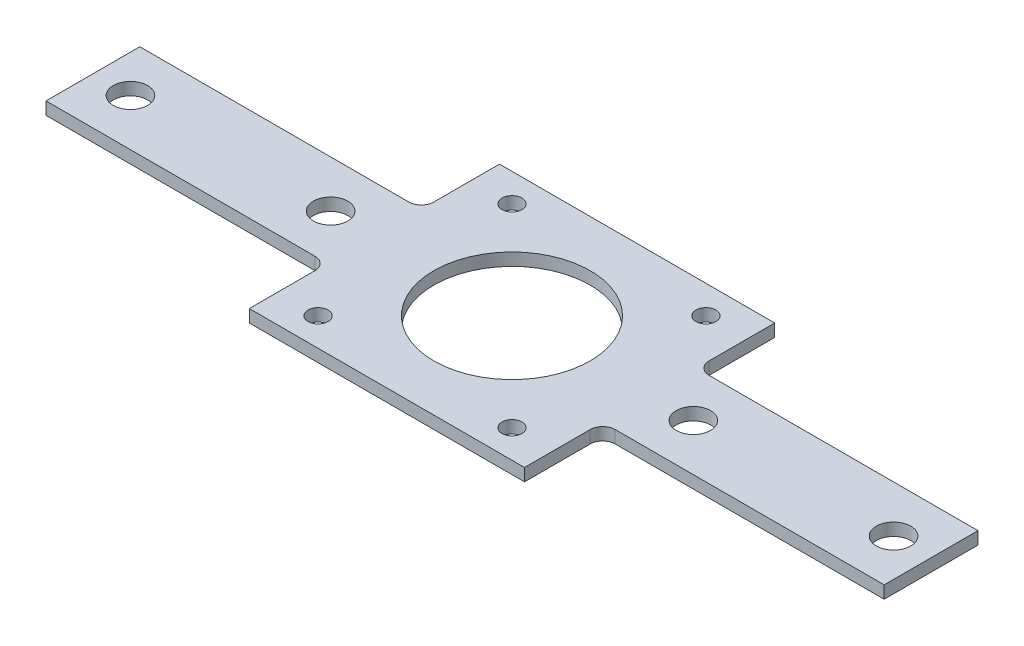
ISO-10303-21;
HEADER;
FILE_DESCRIPTION(('STEP AP214'),'2;1');
FILE_NAME('part.step','',(''),(''),'','','');
FILE_SCHEMA(('AUTOMOTIVE_DESIGN { 1 0 10303 214 1 1 1 1 }'));
ENDSEC;
DATA;
#1=APPLICATION_CONTEXT('core data for automotive mechanical design processes');
#2=APPLICATION_PROTOCOL_DEFINITION('international standard','automotive_design',2000,#1);
#3=PRODUCT_CONTEXT('',#1,'mechanical');
#4=PRODUCT('Part','Part','',(#3));
#5=PRODUCT_RELATED_PRODUCT_CATEGORY('part','',(#4));
#6=PRODUCT_DEFINITION_FORMATION('','',#4);
#7=PRODUCT_DEFINITION_CONTEXT('part definition',#1,'design');
#8=PRODUCT_DEFINITION('design','',#6,#7);
#9=PRODUCT_DEFINITION_SHAPE('','',#8);
#10=(LENGTH_UNIT() NAMED_UNIT(*) SI_UNIT(.MILLI.,.METRE.));
#11=(NAMED_UNIT(*) PLANE_ANGLE_UNIT() SI_UNIT($,.RADIAN.));
#12=(NAMED_UNIT(*) SI_UNIT($,.STERADIAN.) SOLID_ANGLE_UNIT());
#13=UNCERTAINTY_MEASURE_WITH_UNIT(LENGTH_MEASURE(1.E-05),#10,'distance_accuracy_value','');
#14=(GEOMETRIC_REPRESENTATION_CONTEXT(3) GLOBAL_UNCERTAINTY_ASSIGNED_CONTEXT((#13)) GLOBAL_UNIT_ASSIGNED_CONTEXT((#10,
#11,#12)) REPRESENTATION_CONTEXT('',''));
#15=CARTESIAN_POINT('',(0.,0.,0.));
#16=DIRECTION('',(0.,0.,1.));
#17=DIRECTION('',(1.,0.,0.));
#18=AXIS2_PLACEMENT_3D('',#15,#16,#17);
#19=CARTESIAN_POINT('',(0.,2.,0.));
#20=DIRECTION('',(0.,1.,0.));
#21=DIRECTION('',(0.,0.,1.));
#22=AXIS2_PLACEMENT_3D('',#19,#20,#21);
#23=PLANE('',#22);
#24=DIRECTION('',(-1.,0.,0.));
#25=VECTOR('',#24,1.);
#26=CARTESIAN_POINT('',(22.,2.,-7.5));
#27=LINE('',#26,#25);
#28=CARTESIAN_POINT('',(67.,2.,-7.5));
#29=VERTEX_POINT('',#28);
#30=CARTESIAN_POINT('',(24.,2.,-7.5));
#31=VERTEX_POINT('',#30);
#32=EDGE_CURVE('E156',#29,#31,#27,.T.);
#33=ORIENTED_EDGE('',*,*,#32,.T.);
#34=CARTESIAN_POINT('',(24.,2.,-9.5));
#35=DIRECTION('',(0.,1.,0.));
#36=DIRECTION('',(0.,0.,1.));
#37=AXIS2_PLACEMENT_3D('',#34,#35,#36);
#38=CIRCLE('',#37,2.);
#39=CARTESIAN_POINT('',(22.,2.,-9.5));
#40=VERTEX_POINT('',#39);
#41=EDGE_CURVE('E11',#31,#40,#38,.F.);
#42=ORIENTED_EDGE('',*,*,#41,.T.);
#43=DIRECTION('',(0.,0.,-1.));
#44=VECTOR('',#43,1.);
#45=CARTESIAN_POINT('',(22.,2.,-20.));
#46=LINE('',#45,#44);
#47=CARTESIAN_POINT('',(22.,2.,-20.));
#48=VERTEX_POINT('',#47);
#49=EDGE_CURVE('E145',#40,#48,#46,.T.);
#50=ORIENTED_EDGE('',*,*,#49,.T.);
#51=DIRECTION('',(-1.,0.,0.));
#52=VECTOR('',#51,1.);
#53=CARTESIAN_POINT('',(-70.,2.,-20.));
#54=LINE('',#53,#52);
#55=CARTESIAN_POINT('',(-22.,2.,-20.));
#56=VERTEX_POINT('',#55);
#57=EDGE_CURVE('E150',#48,#56,#54,.T.);
#58=ORIENTED_EDGE('',*,*,#57,.T.);
#59=DIRECTION('',(0.,0.,1.));
#60=VECTOR('',#59,1.);
#61=CARTESIAN_POINT('',(-22.,2.,-20.));
#62=LINE('',#61,#60);
#63=CARTESIAN_POINT('',(-22.,2.,-9.5));
#64=VERTEX_POINT('',#63);
#65=EDGE_CURVE('E257',#56,#64,#62,.T.);
#66=ORIENTED_EDGE('',*,*,#65,.T.);
#67=CARTESIAN_POINT('',(-24.,2.,-9.5));
#68=DIRECTION('',(0.,1.,0.));
#69=DIRECTION('',(0.,0.,1.));
#70=AXIS2_PLACEMENT_3D('',#67,#68,#69);
#71=CIRCLE('',#70,2.);
#72=CARTESIAN_POINT('',(-24.,2.,-7.5));
#73=VERTEX_POINT('',#72);
#74=EDGE_CURVE('E209',#64,#73,#71,.F.);
#75=ORIENTED_EDGE('',*,*,#74,.T.);
#76=DIRECTION('',(-1.,0.,0.));
#77=VECTOR('',#76,1.);
#78=CARTESIAN_POINT('',(-22.,2.,-7.5));
#79=LINE('',#78,#77);
#80=CARTESIAN_POINT('',(-67.,2.,-7.5));
#81=VERTEX_POINT('',#80);
#82=EDGE_CURVE('E259',#73,#81,#79,.T.);
#83=ORIENTED_EDGE('',*,*,#82,.T.);
#84=DIRECTION('',(0.,0.,1.));
#85=VECTOR('',#84,1.);
#86=CARTESIAN_POINT('',(-67.,2.,-7.5));
#87=LINE('',#86,#85);
#88=CARTESIAN_POINT('',(-67.,2.,7.5));
#89=VERTEX_POINT('',#88);
#90=EDGE_CURVE('E261',#81,#89,#87,.T.);
#91=ORIENTED_EDGE('',*,*,#90,.T.);
#92=DIRECTION('',(1.,0.,0.));
#93=VECTOR('',#92,1.);
#94=CARTESIAN_POINT('',(-67.,2.,7.5));
#95=LINE('',#94,#93);
#96=CARTESIAN_POINT('',(-24.,2.,7.5));
#97=VERTEX_POINT('',#96);
#98=EDGE_CURVE('E264',#89,#97,#95,.T.);
#99=ORIENTED_EDGE('',*,*,#98,.T.);
#100=CARTESIAN_POINT('',(-24.,2.,9.5));
#101=DIRECTION('',(0.,1.,0.));
#102=DIRECTION('',(0.,0.,1.));
#103=AXIS2_PLACEMENT_3D('',#100,#101,#102);
#104=CIRCLE('',#103,2.);
#105=CARTESIAN_POINT('',(-22.,2.,9.5));
#106=VERTEX_POINT('',#105);
#107=EDGE_CURVE('E205',#97,#106,#104,.F.);
#108=ORIENTED_EDGE('',*,*,#107,.T.);
#109=DIRECTION('',(0.,0.,1.));
#110=VECTOR('',#109,1.);
#111=CARTESIAN_POINT('',(-22.,2.,7.5));
#112=LINE('',#111,#110);
#113=CARTESIAN_POINT('',(-22.,2.,20.));
#114=VERTEX_POINT('',#113);
#115=EDGE_CURVE('E267',#106,#114,#112,.T.);
#116=ORIENTED_EDGE('',*,*,#115,.T.);
#117=DIRECTION('',(1.,0.,0.));
#118=VECTOR('',#117,1.);
#119=CARTESIAN_POINT('',(-70.,2.,20.));
#120=LINE('',#119,#118);
#121=CARTESIAN_POINT('',(22.,2.,20.));
#122=VERTEX_POINT('',#121);
#123=EDGE_CURVE('E171',#114,#122,#120,.T.);
#124=ORIENTED_EDGE('',*,*,#123,.T.);
#125=DIRECTION('',(0.,0.,-1.));
#126=VECTOR('',#125,1.);
#127=CARTESIAN_POINT('',(22.,2.,7.5));
#128=LINE('',#127,#126);
#129=CARTESIAN_POINT('',(22.,2.,9.5));
#130=VERTEX_POINT('',#129);
#131=EDGE_CURVE('E220',#122,#130,#128,.T.);
#132=ORIENTED_EDGE('',*,*,#131,.T.);
#133=CARTESIAN_POINT('',(24.,2.,9.5));
#134=DIRECTION('',(0.,1.,0.));
#135=DIRECTION('',(0.,0.,1.));
#136=AXIS2_PLACEMENT_3D('',#133,#134,#135);
#137=CIRCLE('',#136,2.);
#138=CARTESIAN_POINT('',(24.,2.,7.5));
#139=VERTEX_POINT('',#138);
#140=EDGE_CURVE('E213',#130,#139,#137,.F.);
#141=ORIENTED_EDGE('',*,*,#140,.T.);
#142=DIRECTION('',(1.,0.,0.));
#143=VECTOR('',#142,1.);
#144=CARTESIAN_POINT('',(67.,2.,7.5));
#145=LINE('',#144,#143);
#146=CARTESIAN_POINT('',(67.,2.,7.5));
#147=VERTEX_POINT('',#146);
#148=EDGE_CURVE('E218',#139,#147,#145,.T.);
#149=ORIENTED_EDGE('',*,*,#148,.T.);
#150=DIRECTION('',(0.,0.,-1.));
#151=VECTOR('',#150,1.);
#152=CARTESIAN_POINT('',(67.,2.,-7.5));
#153=LINE('',#152,#151);
#154=EDGE_CURVE('E230',#147,#29,#153,.T.);
#155=ORIENTED_EDGE('',*,*,#154,.T.);
#156=EDGE_LOOP('',(#33,#42,#50,#58,#66,#75,#83,#91,#99,#108,#116,#124,#132,#141,#149,#155));
#157=FACE_BOUND('',#156,.T.);
#158=CARTESIAN_POINT('',(15.5,2.,15.5));
#159=DIRECTION('',(0.,1.,0.));
#160=DIRECTION('',(0.,0.,1.));
#161=AXIS2_PLACEMENT_3D('',#158,#159,#160);
#162=CIRCLE('',#161,1.6);
#163=CARTESIAN_POINT('',(15.5,2.,17.1));
#164=VERTEX_POINT('',#163);
#165=EDGE_CURVE('E297',#164,#164,#162,.T.);
#166=ORIENTED_EDGE('',*,*,#165,.F.);
#167=EDGE_LOOP('',(#166));
#168=FACE_BOUND('',#167,.T.);
#169=CARTESIAN_POINT('',(-15.5,2.,-15.5));
#170=DIRECTION('',(0.,1.,0.));
#171=DIRECTION('',(0.,0.,1.));
#172=AXIS2_PLACEMENT_3D('',#169,#170,#171);
#173=CIRCLE('',#172,1.6);
#174=CARTESIAN_POINT('',(-15.5,2.,-13.9));
#175=VERTEX_POINT('',#174);
#176=EDGE_CURVE('E309',#175,#175,#173,.T.);
#177=ORIENTED_EDGE('',*,*,#176,.F.);
#178=EDGE_LOOP('',(#177));
#179=FACE_BOUND('',#178,.T.);
#180=CARTESIAN_POINT('',(29.,2.,0.));
#181=DIRECTION('',(0.,1.,0.));
#182=DIRECTION('',(0.,0.,1.));
#183=AXIS2_PLACEMENT_3D('',#180,#181,#182);
#184=CIRCLE('',#183,2.74999999999999);
#185=CARTESIAN_POINT('',(29.,2.,2.74999999999999));
#186=VERTEX_POINT('',#185);
#187=EDGE_CURVE('E321',#186,#186,#184,.T.);
#188=ORIENTED_EDGE('',*,*,#187,.F.);
#189=EDGE_LOOP('',(#188));
#190=FACE_BOUND('',#189,.T.);
#191=CARTESIAN_POINT('',(0.,2.,0.));
#192=DIRECTION('',(0.,1.,0.));
#193=DIRECTION('',(0.,0.,1.));
#194=AXIS2_PLACEMENT_3D('',#191,#192,#193);
#195=CIRCLE('',#194,12.5);
#196=CARTESIAN_POINT('',(0.,2.,12.5));
#197=VERTEX_POINT('',#196);
#198=EDGE_CURVE('E333',#197,#197,#195,.T.);
#199=ORIENTED_EDGE('',*,*,#198,.F.);
#200=EDGE_LOOP('',(#199));
#201=FACE_BOUND('',#200,.T.);
#202=CARTESIAN_POINT('',(-61.,2.,0.));
#203=DIRECTION('',(0.,1.,0.));
#204=DIRECTION('',(0.,0.,1.));
#205=AXIS2_PLACEMENT_3D('',#202,#203,#204);
#206=CIRCLE('',#205,2.75000000000001);
#207=CARTESIAN_POINT('',(-61.,2.,2.75000000000001));
#208=VERTEX_POINT('',#207);
#209=EDGE_CURVE('E184',#208,#208,#206,.T.);
#210=ORIENTED_EDGE('',*,*,#209,.F.);
#211=EDGE_LOOP('',(#210));
#212=FACE_BOUND('',#211,.T.);
#213=CARTESIAN_POINT('',(-29.,2.,0.));
#214=DIRECTION('',(0.,1.,0.));
#215=DIRECTION('',(0.,0.,1.));
#216=AXIS2_PLACEMENT_3D('',#213,#214,#215);
#217=CIRCLE('',#216,2.75);
#218=CARTESIAN_POINT('',(-29.,2.,2.75));
#219=VERTEX_POINT('',#218);
#220=EDGE_CURVE('E327',#219,#219,#217,.T.);
#221=ORIENTED_EDGE('',*,*,#220,.F.);
#222=EDGE_LOOP('',(#221));
#223=FACE_BOUND('',#222,.T.);
#224=CARTESIAN_POINT('',(61.,2.,0.));
#225=DIRECTION('',(0.,1.,0.));
#226=DIRECTION('',(0.,0.,1.));
#227=AXIS2_PLACEMENT_3D('',#224,#225,#226);
#228=CIRCLE('',#227,2.75000000000001);
#229=CARTESIAN_POINT('',(61.,2.,2.75000000000001));
#230=VERTEX_POINT('',#229);
#231=EDGE_CURVE('E315',#230,#230,#228,.T.);
#232=ORIENTED_EDGE('',*,*,#231,.F.);
#233=EDGE_LOOP('',(#232));
#234=FACE_BOUND('',#233,.T.);
#235=CARTESIAN_POINT('',(15.5,2.,-15.5));
#236=DIRECTION('',(0.,1.,0.));
#237=DIRECTION('',(0.,0.,1.));
#238=AXIS2_PLACEMENT_3D('',#235,#236,#237);
#239=CIRCLE('',#238,1.6);
#240=CARTESIAN_POINT('',(15.5,2.,-13.9));
#241=VERTEX_POINT('',#240);
#242=EDGE_CURVE('E303',#241,#241,#239,.T.);
#243=ORIENTED_EDGE('',*,*,#242,.F.);
#244=EDGE_LOOP('',(#243));
#245=FACE_BOUND('',#244,.T.);
#246=CARTESIAN_POINT('',(-15.5,2.,15.5));
#247=DIRECTION('',(0.,1.,0.));
#248=DIRECTION('',(0.,0.,1.));
#249=AXIS2_PLACEMENT_3D('',#246,#247,#248);
#250=CIRCLE('',#249,1.6);
#251=CARTESIAN_POINT('',(-15.5,2.,17.1));
#252=VERTEX_POINT('',#251);
#253=EDGE_CURVE('E291',#252,#252,#250,.T.);
#254=ORIENTED_EDGE('',*,*,#253,.F.);
#255=EDGE_LOOP('',(#254));
#256=FACE_BOUND('',#255,.T.);
#257=ADVANCED_FACE('F33',(#157,#168,#179,#190,#201,#212,#223,#234,#245,#256),#23,.T.);
#258=CARTESIAN_POINT('',(0.,0.,0.));
#259=DIRECTION('',(0.,1.,0.));
#260=DIRECTION('',(0.,0.,1.));
#261=AXIS2_PLACEMENT_3D('',#258,#259,#260);
#262=PLANE('',#261);
#263=DIRECTION('',(-1.,0.,0.));
#264=VECTOR('',#263,1.);
#265=CARTESIAN_POINT('',(-70.,0.,-20.));
#266=LINE('',#265,#264);
#267=CARTESIAN_POINT('',(22.,0.,-20.));
#268=VERTEX_POINT('',#267);
#269=CARTESIAN_POINT('',(-22.,0.,-20.));
#270=VERTEX_POINT('',#269);
#271=EDGE_CURVE('E178',#268,#270,#266,.T.);
#272=ORIENTED_EDGE('',*,*,#271,.F.);
#273=DIRECTION('',(0.,0.,-1.));
#274=VECTOR('',#273,1.);
#275=CARTESIAN_POINT('',(22.,0.,-20.));
#276=LINE('',#275,#274);
#277=CARTESIAN_POINT('',(22.,0.,-9.5));
#278=VERTEX_POINT('',#277);
#279=EDGE_CURVE('E161',#278,#268,#276,.T.);
#280=ORIENTED_EDGE('',*,*,#279,.F.);
#281=CARTESIAN_POINT('',(24.,0.,-9.5));
#282=DIRECTION('',(0.,1.,0.));
#283=DIRECTION('',(0.,0.,1.));
#284=AXIS2_PLACEMENT_3D('',#281,#282,#283);
#285=CIRCLE('',#284,2.);
#286=CARTESIAN_POINT('',(24.,0.,-7.5));
#287=VERTEX_POINT('',#286);
#288=EDGE_CURVE('E41',#278,#287,#285,.T.);
#289=ORIENTED_EDGE('',*,*,#288,.T.);
#290=DIRECTION('',(-1.,0.,0.));
#291=VECTOR('',#290,1.);
#292=CARTESIAN_POINT('',(22.,0.,-7.5));
#293=LINE('',#292,#291);
#294=CARTESIAN_POINT('',(67.,0.,-7.5));
#295=VERTEX_POINT('',#294);
#296=EDGE_CURVE('E251',#295,#287,#293,.T.);
#297=ORIENTED_EDGE('',*,*,#296,.F.);
#298=DIRECTION('',(0.,0.,-1.));
#299=VECTOR('',#298,1.);
#300=CARTESIAN_POINT('',(67.,0.,-7.5));
#301=LINE('',#300,#299);
#302=CARTESIAN_POINT('',(67.,0.,7.5));
#303=VERTEX_POINT('',#302);
#304=EDGE_CURVE('E245',#303,#295,#301,.T.);
#305=ORIENTED_EDGE('',*,*,#304,.F.);
#306=DIRECTION('',(1.,0.,0.));
#307=VECTOR('',#306,1.);
#308=CARTESIAN_POINT('',(67.,0.,7.5));
#309=LINE('',#308,#307);
#310=CARTESIAN_POINT('',(24.,0.,7.5));
#311=VERTEX_POINT('',#310);
#312=EDGE_CURVE('E239',#311,#303,#309,.T.);
#313=ORIENTED_EDGE('',*,*,#312,.F.);
#314=CARTESIAN_POINT('',(24.,0.,9.5));
#315=DIRECTION('',(0.,1.,0.));
#316=DIRECTION('',(0.,0.,1.));
#317=AXIS2_PLACEMENT_3D('',#314,#315,#316);
#318=CIRCLE('',#317,2.);
#319=CARTESIAN_POINT('',(22.,0.,9.5));
#320=VERTEX_POINT('',#319);
#321=EDGE_CURVE('E211',#311,#320,#318,.T.);
#322=ORIENTED_EDGE('',*,*,#321,.T.);
#323=DIRECTION('',(0.,0.,-1.));
#324=VECTOR('',#323,1.);
#325=CARTESIAN_POINT('',(22.,0.,7.5));
#326=LINE('',#325,#324);
#327=CARTESIAN_POINT('',(22.,0.,20.));
#328=VERTEX_POINT('',#327);
#329=EDGE_CURVE('E155',#328,#320,#326,.T.);
#330=ORIENTED_EDGE('',*,*,#329,.F.);
#331=DIRECTION('',(1.,0.,0.));
#332=VECTOR('',#331,1.);
#333=CARTESIAN_POINT('',(-70.,0.,20.));
#334=LINE('',#333,#332);
#335=CARTESIAN_POINT('',(-22.,0.,20.));
#336=VERTEX_POINT('',#335);
#337=EDGE_CURVE('E172',#336,#328,#334,.T.);
#338=ORIENTED_EDGE('',*,*,#337,.F.);
#339=DIRECTION('',(0.,0.,1.));
#340=VECTOR('',#339,1.);
#341=CARTESIAN_POINT('',(-22.,0.,7.5));
#342=LINE('',#341,#340);
#343=CARTESIAN_POINT('',(-22.,0.,9.5));
#344=VERTEX_POINT('',#343);
#345=EDGE_CURVE('E280',#344,#336,#342,.T.);
#346=ORIENTED_EDGE('',*,*,#345,.F.);
#347=CARTESIAN_POINT('',(-24.,0.,9.5));
#348=DIRECTION('',(0.,1.,0.));
#349=DIRECTION('',(0.,0.,1.));
#350=AXIS2_PLACEMENT_3D('',#347,#348,#349);
#351=CIRCLE('',#350,2.);
#352=CARTESIAN_POINT('',(-24.,0.,7.5));
#353=VERTEX_POINT('',#352);
#354=EDGE_CURVE('E203',#344,#353,#351,.T.);
#355=ORIENTED_EDGE('',*,*,#354,.T.);
#356=DIRECTION('',(1.,0.,0.));
#357=VECTOR('',#356,1.);
#358=CARTESIAN_POINT('',(-67.,0.,7.5));
#359=LINE('',#358,#357);
#360=CARTESIAN_POINT('',(-67.,0.,7.5));
#361=VERTEX_POINT('',#360);
#362=EDGE_CURVE('E277',#361,#353,#359,.T.);
#363=ORIENTED_EDGE('',*,*,#362,.F.);
#364=DIRECTION('',(0.,0.,1.));
#365=VECTOR('',#364,1.);
#366=CARTESIAN_POINT('',(-67.,0.,-7.5));
#367=LINE('',#366,#365);
#368=CARTESIAN_POINT('',(-67.,0.,-7.5));
#369=VERTEX_POINT('',#368);
#370=EDGE_CURVE('E274',#369,#361,#367,.T.);
#371=ORIENTED_EDGE('',*,*,#370,.F.);
#372=DIRECTION('',(-1.,0.,0.));
#373=VECTOR('',#372,1.);
#374=CARTESIAN_POINT('',(-22.,0.,-7.5));
#375=LINE('',#374,#373);
#376=CARTESIAN_POINT('',(-24.,0.,-7.5));
#377=VERTEX_POINT('',#376);
#378=EDGE_CURVE('E272',#377,#369,#375,.T.);
#379=ORIENTED_EDGE('',*,*,#378,.F.);
#380=CARTESIAN_POINT('',(-24.,0.,-9.5));
#381=DIRECTION('',(0.,1.,0.));
#382=DIRECTION('',(0.,0.,1.));
#383=AXIS2_PLACEMENT_3D('',#380,#381,#382);
#384=CIRCLE('',#383,2.);
#385=CARTESIAN_POINT('',(-22.,0.,-9.5));
#386=VERTEX_POINT('',#385);
#387=EDGE_CURVE('E207',#377,#386,#384,.T.);
#388=ORIENTED_EDGE('',*,*,#387,.T.);
#389=DIRECTION('',(0.,0.,1.));
#390=VECTOR('',#389,1.);
#391=CARTESIAN_POINT('',(-22.,0.,-20.));
#392=LINE('',#391,#390);
#393=EDGE_CURVE('E269',#270,#386,#392,.T.);
#394=ORIENTED_EDGE('',*,*,#393,.F.);
#395=EDGE_LOOP('',(#272,#280,#289,#297,#305,#313,#322,#330,#338,#346,#355,#363,#371,#379,#388,#394));
#396=FACE_BOUND('',#395,.T.);
#397=CARTESIAN_POINT('',(-61.,0.,0.));
#398=DIRECTION('',(0.,1.,0.));
#399=DIRECTION('',(0.,0.,1.));
#400=AXIS2_PLACEMENT_3D('',#397,#398,#399);
#401=CIRCLE('',#400,2.75000000000001);
#402=CARTESIAN_POINT('',(-61.,0.,2.75000000000001));
#403=VERTEX_POINT('',#402);
#404=EDGE_CURVE('E181',#403,#403,#401,.T.);
#405=ORIENTED_EDGE('',*,*,#404,.T.);
#406=EDGE_LOOP('',(#405));
#407=FACE_BOUND('',#406,.T.);
#408=CARTESIAN_POINT('',(0.,0.,0.));
#409=DIRECTION('',(0.,1.,0.));
#410=DIRECTION('',(0.,0.,1.));
#411=AXIS2_PLACEMENT_3D('',#408,#409,#410);
#412=CIRCLE('',#411,12.5);
#413=CARTESIAN_POINT('',(0.,0.,12.5));
#414=VERTEX_POINT('',#413);
#415=EDGE_CURVE('E330',#414,#414,#412,.T.);
#416=ORIENTED_EDGE('',*,*,#415,.T.);
#417=EDGE_LOOP('',(#416));
#418=FACE_BOUND('',#417,.T.);
#419=CARTESIAN_POINT('',(-29.,0.,0.));
#420=DIRECTION('',(0.,1.,0.));
#421=DIRECTION('',(0.,0.,1.));
#422=AXIS2_PLACEMENT_3D('',#419,#420,#421);
#423=CIRCLE('',#422,2.75);
#424=CARTESIAN_POINT('',(-29.,0.,2.75));
#425=VERTEX_POINT('',#424);
#426=EDGE_CURVE('E324',#425,#425,#423,.T.);
#427=ORIENTED_EDGE('',*,*,#426,.T.);
#428=EDGE_LOOP('',(#427));
#429=FACE_BOUND('',#428,.T.);
#430=CARTESIAN_POINT('',(29.,0.,0.));
#431=DIRECTION('',(0.,1.,0.));
#432=DIRECTION('',(0.,0.,1.));
#433=AXIS2_PLACEMENT_3D('',#430,#431,#432);
#434=CIRCLE('',#433,2.74999999999999);
#435=CARTESIAN_POINT('',(29.,0.,2.74999999999999));
#436=VERTEX_POINT('',#435);
#437=EDGE_CURVE('E318',#436,#436,#434,.T.);
#438=ORIENTED_EDGE('',*,*,#437,.T.);
#439=EDGE_LOOP('',(#438));
#440=FACE_BOUND('',#439,.T.);
#441=CARTESIAN_POINT('',(61.,0.,0.));
#442=DIRECTION('',(0.,1.,0.));
#443=DIRECTION('',(0.,0.,1.));
#444=AXIS2_PLACEMENT_3D('',#441,#442,#443);
#445=CIRCLE('',#444,2.75000000000001);
#446=CARTESIAN_POINT('',(61.,0.,2.75000000000001));
#447=VERTEX_POINT('',#446);
#448=EDGE_CURVE('E312',#447,#447,#445,.T.);
#449=ORIENTED_EDGE('',*,*,#448,.T.);
#450=EDGE_LOOP('',(#449));
#451=FACE_BOUND('',#450,.T.);
#452=CARTESIAN_POINT('',(-15.5,0.,-15.5));
#453=DIRECTION('',(0.,1.,0.));
#454=DIRECTION('',(0.,0.,1.));
#455=AXIS2_PLACEMENT_3D('',#452,#453,#454);
#456=CIRCLE('',#455,1.6);
#457=CARTESIAN_POINT('',(-15.5,0.,-13.9));
#458=VERTEX_POINT('',#457);
#459=EDGE_CURVE('E306',#458,#458,#456,.T.);
#460=ORIENTED_EDGE('',*,*,#459,.T.);
#461=EDGE_LOOP('',(#460));
#462=FACE_BOUND('',#461,.T.);
#463=CARTESIAN_POINT('',(15.5,0.,-15.5));
#464=DIRECTION('',(0.,1.,0.));
#465=DIRECTION('',(0.,0.,1.));
#466=AXIS2_PLACEMENT_3D('',#463,#464,#465);
#467=CIRCLE('',#466,1.6);
#468=CARTESIAN_POINT('',(15.5,0.,-13.9));
#469=VERTEX_POINT('',#468);
#470=EDGE_CURVE('E300',#469,#469,#467,.T.);
#471=ORIENTED_EDGE('',*,*,#470,.T.);
#472=EDGE_LOOP('',(#471));
#473=FACE_BOUND('',#472,.T.);
#474=CARTESIAN_POINT('',(15.5,0.,15.5));
#475=DIRECTION('',(0.,1.,0.));
#476=DIRECTION('',(0.,0.,1.));
#477=AXIS2_PLACEMENT_3D('',#474,#475,#476);
#478=CIRCLE('',#477,1.6);
#479=CARTESIAN_POINT('',(15.5,0.,17.1));
#480=VERTEX_POINT('',#479);
#481=EDGE_CURVE('E294',#480,#480,#478,.T.);
#482=ORIENTED_EDGE('',*,*,#481,.T.);
#483=EDGE_LOOP('',(#482));
#484=FACE_BOUND('',#483,.T.);
#485=CARTESIAN_POINT('',(-15.5,0.,15.5));
#486=DIRECTION('',(0.,1.,0.));
#487=DIRECTION('',(0.,0.,1.));
#488=AXIS2_PLACEMENT_3D('',#485,#486,#487);
#489=CIRCLE('',#488,1.6);
#490=CARTESIAN_POINT('',(-15.5,0.,17.1));
#491=VERTEX_POINT('',#490);
#492=EDGE_CURVE('E165',#491,#491,#489,.T.);
#493=ORIENTED_EDGE('',*,*,#492,.T.);
#494=EDGE_LOOP('',(#493));
#495=FACE_BOUND('',#494,.T.);
#496=ADVANCED_FACE('F235',(#396,#407,#418,#429,#440,#451,#462,#473,#484,#495),#262,.F.);
#497=CARTESIAN_POINT('',(-70.,2.,-20.));
#498=DIRECTION('',(0.,0.,1.));
#499=DIRECTION('',(1.,0.,0.));
#500=AXIS2_PLACEMENT_3D('',#497,#498,#499);
#501=PLANE('',#500);
#502=ORIENTED_EDGE('',*,*,#57,.F.);
#503=DIRECTION('',(0.,-1.,0.));
#504=VECTOR('',#503,1.);
#505=CARTESIAN_POINT('',(22.,2.001,-20.));
#506=LINE('',#505,#504);
#507=EDGE_CURVE('E159',#48,#268,#506,.T.);
#508=ORIENTED_EDGE('',*,*,#507,.T.);
#509=ORIENTED_EDGE('',*,*,#271,.T.);
#510=DIRECTION('',(0.,-1.,0.));
#511=VECTOR('',#510,1.);
#512=CARTESIAN_POINT('',(-22.,2.001,-20.));
#513=LINE('',#512,#511);
#514=EDGE_CURVE('E170',#56,#270,#513,.T.);
#515=ORIENTED_EDGE('',*,*,#514,.F.);
#516=EDGE_LOOP('',(#502,#508,#509,#515));
#517=FACE_BOUND('',#516,.T.);
#518=ADVANCED_FACE('F169',(#517),#501,.F.);
#519=CARTESIAN_POINT('',(-70.,2.,20.));
#520=DIRECTION('',(0.,0.,-1.));
#521=DIRECTION('',(-1.,0.,0.));
#522=AXIS2_PLACEMENT_3D('',#519,#520,#521);
#523=PLANE('',#522);
#524=ORIENTED_EDGE('',*,*,#337,.T.);
#525=DIRECTION('',(0.,-1.,0.));
#526=VECTOR('',#525,1.);
#527=CARTESIAN_POINT('',(22.,2.001,20.));
#528=LINE('',#527,#526);
#529=EDGE_CURVE('E243',#122,#328,#528,.T.);
#530=ORIENTED_EDGE('',*,*,#529,.F.);
#531=ORIENTED_EDGE('',*,*,#123,.F.);
#532=DIRECTION('',(0.,-1.,0.));
#533=VECTOR('',#532,1.);
#534=CARTESIAN_POINT('',(-22.,2.001,20.));
#535=LINE('',#534,#533);
#536=EDGE_CURVE('E282',#114,#336,#535,.T.);
#537=ORIENTED_EDGE('',*,*,#536,.T.);
#538=EDGE_LOOP('',(#524,#530,#531,#537));
#539=FACE_BOUND('',#538,.T.);
#540=ADVANCED_FACE('F347',(#539),#523,.F.);
#541=CARTESIAN_POINT('',(-61.,2.,0.));
#542=DIRECTION('',(0.,-1.,0.));
#543=DIRECTION('',(0.,0.,-1.));
#544=AXIS2_PLACEMENT_3D('',#541,#542,#543);
#545=CYLINDRICAL_SURFACE('',#544,2.75000000000001);
#546=ORIENTED_EDGE('',*,*,#209,.T.);
#547=EDGE_LOOP('',(#546));
#548=FACE_BOUND('',#547,.T.);
#549=ORIENTED_EDGE('',*,*,#404,.F.);
#550=EDGE_LOOP('',(#549));
#551=FACE_BOUND('',#550,.T.);
#552=ADVANCED_FACE('F344',(#548,#551),#545,.F.);
#553=CARTESIAN_POINT('',(0.,2.,0.));
#554=DIRECTION('',(0.,-1.,0.));
#555=DIRECTION('',(0.,0.,-1.));
#556=AXIS2_PLACEMENT_3D('',#553,#554,#555);
#557=CYLINDRICAL_SURFACE('',#556,12.5);
#558=ORIENTED_EDGE('',*,*,#198,.T.);
#559=EDGE_LOOP('',(#558));
#560=FACE_BOUND('',#559,.T.);
#561=ORIENTED_EDGE('',*,*,#415,.F.);
#562=EDGE_LOOP('',(#561));
#563=FACE_BOUND('',#562,.T.);
#564=ADVANCED_FACE('F346',(#560,#563),#557,.F.);
#565=CARTESIAN_POINT('',(-29.,2.,0.));
#566=DIRECTION('',(0.,-1.,0.));
#567=DIRECTION('',(0.,0.,-1.));
#568=AXIS2_PLACEMENT_3D('',#565,#566,#567);
#569=CYLINDRICAL_SURFACE('',#568,2.75);
#570=ORIENTED_EDGE('',*,*,#220,.T.);
#571=EDGE_LOOP('',(#570));
#572=FACE_BOUND('',#571,.T.);
#573=ORIENTED_EDGE('',*,*,#426,.F.);
#574=EDGE_LOOP('',(#573));
#575=FACE_BOUND('',#574,.T.);
#576=ADVANCED_FACE('F353',(#572,#575),#569,.F.);
#577=CARTESIAN_POINT('',(29.,2.,0.));
#578=DIRECTION('',(0.,-1.,0.));
#579=DIRECTION('',(0.,0.,-1.));
#580=AXIS2_PLACEMENT_3D('',#577,#578,#579);
#581=CYLINDRICAL_SURFACE('',#580,2.74999999999999);
#582=ORIENTED_EDGE('',*,*,#187,.T.);
#583=EDGE_LOOP('',(#582));
#584=FACE_BOUND('',#583,.T.);
#585=ORIENTED_EDGE('',*,*,#437,.F.);
#586=EDGE_LOOP('',(#585));
#587=FACE_BOUND('',#586,.T.);
#588=ADVANCED_FACE('F443',(#584,#587),#581,.F.);
#589=CARTESIAN_POINT('',(61.,2.,0.));
#590=DIRECTION('',(0.,-1.,0.));
#591=DIRECTION('',(0.,0.,-1.));
#592=AXIS2_PLACEMENT_3D('',#589,#590,#591);
#593=CYLINDRICAL_SURFACE('',#592,2.75000000000001);
#594=ORIENTED_EDGE('',*,*,#231,.T.);
#595=EDGE_LOOP('',(#594));
#596=FACE_BOUND('',#595,.T.);
#597=ORIENTED_EDGE('',*,*,#448,.F.);
#598=EDGE_LOOP('',(#597));
#599=FACE_BOUND('',#598,.T.);
#600=ADVANCED_FACE('F439',(#596,#599),#593,.F.);
#601=CARTESIAN_POINT('',(-15.5,2.,-15.5));
#602=DIRECTION('',(0.,-1.,0.));
#603=DIRECTION('',(0.,0.,-1.));
#604=AXIS2_PLACEMENT_3D('',#601,#602,#603);
#605=CYLINDRICAL_SURFACE('',#604,1.6);
#606=ORIENTED_EDGE('',*,*,#176,.T.);
#607=EDGE_LOOP('',(#606));
#608=FACE_BOUND('',#607,.T.);
#609=ORIENTED_EDGE('',*,*,#459,.F.);
#610=EDGE_LOOP('',(#609));
#611=FACE_BOUND('',#610,.T.);
#612=ADVANCED_FACE('F435',(#608,#611),#605,.F.);
#613=CARTESIAN_POINT('',(15.5,2.,-15.5));
#614=DIRECTION('',(0.,-1.,0.));
#615=DIRECTION('',(0.,0.,-1.));
#616=AXIS2_PLACEMENT_3D('',#613,#614,#615);
#617=CYLINDRICAL_SURFACE('',#616,1.6);
#618=ORIENTED_EDGE('',*,*,#242,.T.);
#619=EDGE_LOOP('',(#618));
#620=FACE_BOUND('',#619,.T.);
#621=ORIENTED_EDGE('',*,*,#470,.F.);
#622=EDGE_LOOP('',(#621));
#623=FACE_BOUND('',#622,.T.);
#624=ADVANCED_FACE('F431',(#620,#623),#617,.F.);
#625=CARTESIAN_POINT('',(15.5,2.,15.5));
#626=DIRECTION('',(0.,-1.,0.));
#627=DIRECTION('',(0.,0.,-1.));
#628=AXIS2_PLACEMENT_3D('',#625,#626,#627);
#629=CYLINDRICAL_SURFACE('',#628,1.6);
#630=ORIENTED_EDGE('',*,*,#165,.T.);
#631=EDGE_LOOP('',(#630));
#632=FACE_BOUND('',#631,.T.);
#633=ORIENTED_EDGE('',*,*,#481,.F.);
#634=EDGE_LOOP('',(#633));
#635=FACE_BOUND('',#634,.T.);
#636=ADVANCED_FACE('F417',(#632,#635),#629,.F.);
#637=CARTESIAN_POINT('',(-15.5,2.,15.5));
#638=DIRECTION('',(0.,-1.,0.));
#639=DIRECTION('',(0.,0.,-1.));
#640=AXIS2_PLACEMENT_3D('',#637,#638,#639);
#641=CYLINDRICAL_SURFACE('',#640,1.6);
#642=ORIENTED_EDGE('',*,*,#253,.T.);
#643=EDGE_LOOP('',(#642));
#644=FACE_BOUND('',#643,.T.);
#645=ORIENTED_EDGE('',*,*,#492,.F.);
#646=EDGE_LOOP('',(#645));
#647=FACE_BOUND('',#646,.T.);
#648=ADVANCED_FACE('F410',(#644,#647),#641,.F.);
#649=CARTESIAN_POINT('',(-22.,2.001,7.5));
#650=DIRECTION('',(1.,0.,0.));
#651=DIRECTION('',(0.,0.,-1.));
#652=AXIS2_PLACEMENT_3D('',#649,#650,#651);
#653=PLANE('',#652);
#654=ORIENTED_EDGE('',*,*,#115,.F.);
#655=DIRECTION('',(0.,-1.,0.));
#656=VECTOR('',#655,1.);
#657=CARTESIAN_POINT('',(-22.,0.,9.5));
#658=LINE('',#657,#656);
#659=EDGE_CURVE('E175',#106,#344,#658,.T.);
#660=ORIENTED_EDGE('',*,*,#659,.T.);
#661=ORIENTED_EDGE('',*,*,#345,.T.);
#662=ORIENTED_EDGE('',*,*,#536,.F.);
#663=EDGE_LOOP('',(#654,#660,#661,#662));
#664=FACE_BOUND('',#663,.T.);
#665=ADVANCED_FACE('F407',(#664),#653,.F.);
#666=CARTESIAN_POINT('',(-67.,2.001,7.5));
#667=DIRECTION('',(0.,0.,-1.));
#668=DIRECTION('',(-1.,0.,0.));
#669=AXIS2_PLACEMENT_3D('',#666,#667,#668);
#670=PLANE('',#669);
#671=ORIENTED_EDGE('',*,*,#362,.T.);
#672=DIRECTION('',(0.,-1.,0.));
#673=VECTOR('',#672,1.);
#674=CARTESIAN_POINT('',(-24.,2.,7.5));
#675=LINE('',#674,#673);
#676=EDGE_CURVE('E188',#353,#97,#675,.F.);
#677=ORIENTED_EDGE('',*,*,#676,.T.);
#678=ORIENTED_EDGE('',*,*,#98,.F.);
#679=DIRECTION('',(0.,-1.,0.));
#680=VECTOR('',#679,1.);
#681=CARTESIAN_POINT('',(-67.,2.001,7.5));
#682=LINE('',#681,#680);
#683=EDGE_CURVE('E285',#89,#361,#682,.T.);
#684=ORIENTED_EDGE('',*,*,#683,.T.);
#685=EDGE_LOOP('',(#671,#677,#678,#684));
#686=FACE_BOUND('',#685,.T.);
#687=ADVANCED_FACE('F401',(#686),#670,.F.);
#688=CARTESIAN_POINT('',(-67.,2.001,-7.5));
#689=DIRECTION('',(1.,0.,0.));
#690=DIRECTION('',(0.,0.,-1.));
#691=AXIS2_PLACEMENT_3D('',#688,#689,#690);
#692=PLANE('',#691);
#693=DIRECTION('',(0.,-1.,0.));
#694=VECTOR('',#693,1.);
#695=CARTESIAN_POINT('',(-67.,2.001,-7.5));
#696=LINE('',#695,#694);
#697=EDGE_CURVE('E287',#81,#369,#696,.T.);
#698=ORIENTED_EDGE('',*,*,#697,.T.);
#699=ORIENTED_EDGE('',*,*,#370,.T.);
#700=ORIENTED_EDGE('',*,*,#683,.F.);
#701=ORIENTED_EDGE('',*,*,#90,.F.);
#702=EDGE_LOOP('',(#698,#699,#700,#701));
#703=FACE_BOUND('',#702,.T.);
#704=ADVANCED_FACE('F395',(#703),#692,.F.);
#705=CARTESIAN_POINT('',(-22.,2.001,-7.5));
#706=DIRECTION('',(0.,0.,1.));
#707=DIRECTION('',(1.,0.,0.));
#708=AXIS2_PLACEMENT_3D('',#705,#706,#707);
#709=PLANE('',#708);
#710=ORIENTED_EDGE('',*,*,#82,.F.);
#711=DIRECTION('',(0.,-1.,0.));
#712=VECTOR('',#711,1.);
#713=CARTESIAN_POINT('',(-24.,0.,-7.5));
#714=LINE('',#713,#712);
#715=EDGE_CURVE('E190',#73,#377,#714,.T.);
#716=ORIENTED_EDGE('',*,*,#715,.T.);
#717=ORIENTED_EDGE('',*,*,#378,.T.);
#718=ORIENTED_EDGE('',*,*,#697,.F.);
#719=EDGE_LOOP('',(#710,#716,#717,#718));
#720=FACE_BOUND('',#719,.T.);
#721=ADVANCED_FACE('F392',(#720),#709,.F.);
#722=CARTESIAN_POINT('',(-22.,2.001,-20.));
#723=DIRECTION('',(1.,0.,0.));
#724=DIRECTION('',(0.,0.,-1.));
#725=AXIS2_PLACEMENT_3D('',#722,#723,#724);
#726=PLANE('',#725);
#727=ORIENTED_EDGE('',*,*,#393,.T.);
#728=DIRECTION('',(0.,-1.,0.));
#729=VECTOR('',#728,1.);
#730=CARTESIAN_POINT('',(-22.,2.,-9.5));
#731=LINE('',#730,#729);
#732=EDGE_CURVE('E193',#386,#64,#731,.F.);
#733=ORIENTED_EDGE('',*,*,#732,.T.);
#734=ORIENTED_EDGE('',*,*,#65,.F.);
#735=ORIENTED_EDGE('',*,*,#514,.T.);
#736=EDGE_LOOP('',(#727,#733,#734,#735));
#737=FACE_BOUND('',#736,.T.);
#738=ADVANCED_FACE('F385',(#737),#726,.F.);
#739=CARTESIAN_POINT('',(22.,2.001,-20.));
#740=DIRECTION('',(-1.,0.,0.));
#741=DIRECTION('',(0.,0.,1.));
#742=AXIS2_PLACEMENT_3D('',#739,#740,#741);
#743=PLANE('',#742);
#744=ORIENTED_EDGE('',*,*,#49,.F.);
#745=DIRECTION('',(0.,-1.,0.));
#746=VECTOR('',#745,1.);
#747=CARTESIAN_POINT('',(22.,0.,-9.5));
#748=LINE('',#747,#746);
#749=EDGE_CURVE('E200',#40,#278,#748,.T.);
#750=ORIENTED_EDGE('',*,*,#749,.T.);
#751=ORIENTED_EDGE('',*,*,#279,.T.);
#752=ORIENTED_EDGE('',*,*,#507,.F.);
#753=EDGE_LOOP('',(#744,#750,#751,#752));
#754=FACE_BOUND('',#753,.T.);
#755=ADVANCED_FACE('F160',(#754),#743,.F.);
#756=CARTESIAN_POINT('',(22.,2.001,-7.5));
#757=DIRECTION('',(0.,0.,1.));
#758=DIRECTION('',(1.,0.,0.));
#759=AXIS2_PLACEMENT_3D('',#756,#757,#758);
#760=PLANE('',#759);
#761=ORIENTED_EDGE('',*,*,#296,.T.);
#762=DIRECTION('',(0.,-1.,0.));
#763=VECTOR('',#762,1.);
#764=CARTESIAN_POINT('',(24.,2.,-7.5));
#765=LINE('',#764,#763);
#766=EDGE_CURVE('E48',#287,#31,#765,.F.);
#767=ORIENTED_EDGE('',*,*,#766,.T.);
#768=ORIENTED_EDGE('',*,*,#32,.F.);
#769=DIRECTION('',(0.,-1.,0.));
#770=VECTOR('',#769,1.);
#771=CARTESIAN_POINT('',(67.,2.001,-7.5));
#772=LINE('',#771,#770);
#773=EDGE_CURVE('E166',#29,#295,#772,.T.);
#774=ORIENTED_EDGE('',*,*,#773,.T.);
#775=EDGE_LOOP('',(#761,#767,#768,#774));
#776=FACE_BOUND('',#775,.T.);
#777=ADVANCED_FACE('F539',(#776),#760,.F.);
#778=CARTESIAN_POINT('',(67.,2.001,-7.5));
#779=DIRECTION('',(-1.,0.,0.));
#780=DIRECTION('',(0.,0.,1.));
#781=AXIS2_PLACEMENT_3D('',#778,#779,#780);
#782=PLANE('',#781);
#783=DIRECTION('',(0.,-1.,0.));
#784=VECTOR('',#783,1.);
#785=CARTESIAN_POINT('',(67.,2.001,7.5));
#786=LINE('',#785,#784);
#787=EDGE_CURVE('E229',#147,#303,#786,.T.);
#788=ORIENTED_EDGE('',*,*,#787,.T.);
#789=ORIENTED_EDGE('',*,*,#304,.T.);
#790=ORIENTED_EDGE('',*,*,#773,.F.);
#791=ORIENTED_EDGE('',*,*,#154,.F.);
#792=EDGE_LOOP('',(#788,#789,#790,#791));
#793=FACE_BOUND('',#792,.T.);
#794=ADVANCED_FACE('F535',(#793),#782,.F.);
#795=CARTESIAN_POINT('',(67.,2.001,7.5));
#796=DIRECTION('',(0.,0.,-1.));
#797=DIRECTION('',(-1.,0.,0.));
#798=AXIS2_PLACEMENT_3D('',#795,#796,#797);
#799=PLANE('',#798);
#800=ORIENTED_EDGE('',*,*,#148,.F.);
#801=DIRECTION('',(0.,-1.,0.));
#802=VECTOR('',#801,1.);
#803=CARTESIAN_POINT('',(24.,0.,7.5));
#804=LINE('',#803,#802);
#805=EDGE_CURVE('E195',#139,#311,#804,.T.);
#806=ORIENTED_EDGE('',*,*,#805,.T.);
#807=ORIENTED_EDGE('',*,*,#312,.T.);
#808=ORIENTED_EDGE('',*,*,#787,.F.);
#809=EDGE_LOOP('',(#800,#806,#807,#808));
#810=FACE_BOUND('',#809,.T.);
#811=ADVANCED_FACE('F226',(#810),#799,.F.);
#812=CARTESIAN_POINT('',(22.,2.001,7.5));
#813=DIRECTION('',(-1.,0.,0.));
#814=DIRECTION('',(0.,0.,1.));
#815=AXIS2_PLACEMENT_3D('',#812,#813,#814);
#816=PLANE('',#815);
#817=ORIENTED_EDGE('',*,*,#329,.T.);
#818=DIRECTION('',(0.,-1.,0.));
#819=VECTOR('',#818,1.);
#820=CARTESIAN_POINT('',(22.,2.,9.5));
#821=LINE('',#820,#819);
#822=EDGE_CURVE('E198',#320,#130,#821,.F.);
#823=ORIENTED_EDGE('',*,*,#822,.T.);
#824=ORIENTED_EDGE('',*,*,#131,.F.);
#825=ORIENTED_EDGE('',*,*,#529,.T.);
#826=EDGE_LOOP('',(#817,#823,#824,#825));
#827=FACE_BOUND('',#826,.T.);
#828=ADVANCED_FACE('F241',(#827),#816,.F.);
#829=CARTESIAN_POINT('',(-24.,2.001,9.5));
#830=DIRECTION('',(0.,1.,0.));
#831=DIRECTION('',(0.,0.,1.));
#832=AXIS2_PLACEMENT_3D('',#829,#830,#831);
#833=CYLINDRICAL_SURFACE('',#832,2.);
#834=ORIENTED_EDGE('',*,*,#107,.F.);
#835=ORIENTED_EDGE('',*,*,#676,.F.);
#836=ORIENTED_EDGE('',*,*,#354,.F.);
#837=ORIENTED_EDGE('',*,*,#659,.F.);
#838=EDGE_LOOP('',(#834,#835,#836,#837));
#839=FACE_BOUND('',#838,.T.);
#840=ADVANCED_FACE('F367',(#839),#833,.F.);
#841=CARTESIAN_POINT('',(-24.,2.001,-9.5));
#842=DIRECTION('',(0.,1.,0.));
#843=DIRECTION('',(0.,0.,1.));
#844=AXIS2_PLACEMENT_3D('',#841,#842,#843);
#845=CYLINDRICAL_SURFACE('',#844,2.);
#846=ORIENTED_EDGE('',*,*,#74,.F.);
#847=ORIENTED_EDGE('',*,*,#732,.F.);
#848=ORIENTED_EDGE('',*,*,#387,.F.);
#849=ORIENTED_EDGE('',*,*,#715,.F.);
#850=EDGE_LOOP('',(#846,#847,#848,#849));
#851=FACE_BOUND('',#850,.T.);
#852=ADVANCED_FACE('F370',(#851),#845,.F.);
#853=CARTESIAN_POINT('',(24.,2.001,9.5));
#854=DIRECTION('',(0.,1.,0.));
#855=DIRECTION('',(0.,0.,1.));
#856=AXIS2_PLACEMENT_3D('',#853,#854,#855);
#857=CYLINDRICAL_SURFACE('',#856,2.);
#858=ORIENTED_EDGE('',*,*,#140,.F.);
#859=ORIENTED_EDGE('',*,*,#822,.F.);
#860=ORIENTED_EDGE('',*,*,#321,.F.);
#861=ORIENTED_EDGE('',*,*,#805,.F.);
#862=EDGE_LOOP('',(#858,#859,#860,#861));
#863=FACE_BOUND('',#862,.T.);
#864=ADVANCED_FACE('F232',(#863),#857,.F.);
#865=CARTESIAN_POINT('',(24.,2.001,-9.5));
#866=DIRECTION('',(0.,1.,0.));
#867=DIRECTION('',(0.,0.,1.));
#868=AXIS2_PLACEMENT_3D('',#865,#866,#867);
#869=CYLINDRICAL_SURFACE('',#868,2.);
#870=ORIENTED_EDGE('',*,*,#41,.F.);
#871=ORIENTED_EDGE('',*,*,#766,.F.);
#872=ORIENTED_EDGE('',*,*,#288,.F.);
#873=ORIENTED_EDGE('',*,*,#749,.F.);
#874=EDGE_LOOP('',(#870,#871,#872,#873));
#875=FACE_BOUND('',#874,.T.);
#876=ADVANCED_FACE('F35',(#875),#869,.F.);
#877=CLOSED_SHELL('',(#257,#496,#518,#540,#552,#564,#576,#588,#600,#612,#624,#636,#648,#665,
#687,#704,#721,#738,#755,#777,#794,#811,#828,#840,#852,#864,#876));
#878=MANIFOLD_SOLID_BREP('B2',#877);
#879=ADVANCED_BREP_SHAPE_REPRESENTATION('',(#18,#878),#14);
#880=SHAPE_DEFINITION_REPRESENTATION(#9,#879);
ENDSEC;
END-ISO-10303-21;
